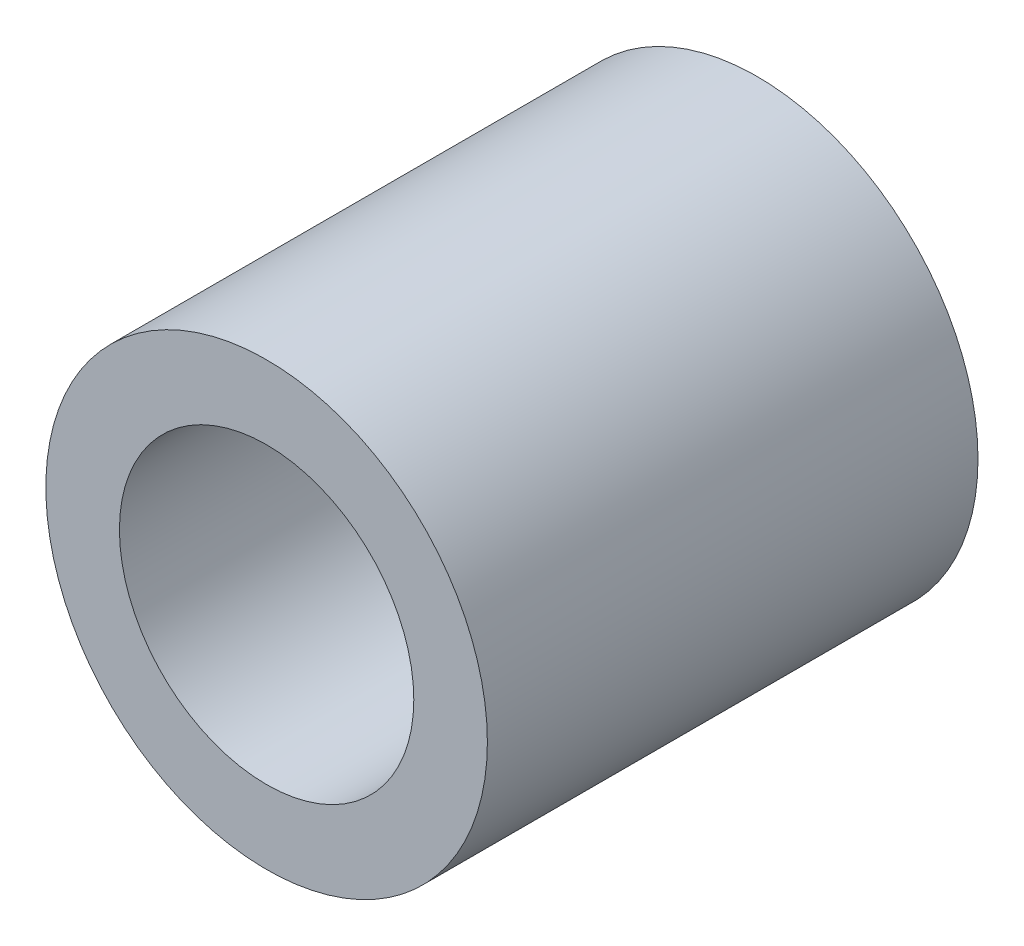
ISO-10303-21;
HEADER;
FILE_DESCRIPTION(('STEP AP214'),'2;1');
FILE_NAME('part.step','',(''),(''),'','','');
FILE_SCHEMA(('AUTOMOTIVE_DESIGN { 1 0 10303 214 1 1 1 1 }'));
ENDSEC;
DATA;
#1=APPLICATION_CONTEXT('core data for automotive mechanical design processes');
#2=APPLICATION_PROTOCOL_DEFINITION('international standard','automotive_design',2000,#1);
#3=PRODUCT_CONTEXT('',#1,'mechanical');
#4=PRODUCT('Part','Part','',(#3));
#5=PRODUCT_RELATED_PRODUCT_CATEGORY('part','',(#4));
#6=PRODUCT_DEFINITION_FORMATION('','',#4);
#7=PRODUCT_DEFINITION_CONTEXT('part definition',#1,'design');
#8=PRODUCT_DEFINITION('design','',#6,#7);
#9=PRODUCT_DEFINITION_SHAPE('','',#8);
#10=(LENGTH_UNIT() NAMED_UNIT(*) SI_UNIT(.MILLI.,.METRE.));
#11=(NAMED_UNIT(*) PLANE_ANGLE_UNIT() SI_UNIT($,.RADIAN.));
#12=(NAMED_UNIT(*) SI_UNIT($,.STERADIAN.) SOLID_ANGLE_UNIT());
#13=UNCERTAINTY_MEASURE_WITH_UNIT(LENGTH_MEASURE(1.E-05),#10,'distance_accuracy_value','');
#14=(GEOMETRIC_REPRESENTATION_CONTEXT(3) GLOBAL_UNCERTAINTY_ASSIGNED_CONTEXT((#13)) GLOBAL_UNIT_ASSIGNED_CONTEXT((#10,
#11,#12)) REPRESENTATION_CONTEXT('',''));
#15=CARTESIAN_POINT('',(0.,0.,0.));
#16=DIRECTION('',(0.,0.,1.));
#17=DIRECTION('',(1.,0.,0.));
#18=AXIS2_PLACEMENT_3D('',#15,#16,#17);
#19=CARTESIAN_POINT('',(0.,0.,10.));
#20=DIRECTION('',(0.,0.,1.));
#21=DIRECTION('',(1.,0.,0.));
#22=AXIS2_PLACEMENT_3D('',#19,#20,#21);
#23=PLANE('',#22);
#24=CARTESIAN_POINT('',(0.,0.,10.));
#25=DIRECTION('',(0.,0.,1.));
#26=DIRECTION('',(1.,0.,0.));
#27=AXIS2_PLACEMENT_3D('',#24,#25,#26);
#28=CIRCLE('',#27,4.5);
#29=CARTESIAN_POINT('',(4.5,0.,10.));
#30=VERTEX_POINT('',#29);
#31=EDGE_CURVE('E11',#30,#30,#28,.T.);
#32=ORIENTED_EDGE('',*,*,#31,.T.);
#33=EDGE_LOOP('',(#32));
#34=FACE_BOUND('',#33,.T.);
#35=CARTESIAN_POINT('',(0.,0.,10.));
#36=DIRECTION('',(0.,0.,1.));
#37=DIRECTION('',(1.,0.,0.));
#38=AXIS2_PLACEMENT_3D('',#35,#36,#37);
#39=CIRCLE('',#38,3.);
#40=CARTESIAN_POINT('',(3.,0.,10.));
#41=VERTEX_POINT('',#40);
#42=EDGE_CURVE('E56',#41,#41,#39,.T.);
#43=ORIENTED_EDGE('',*,*,#42,.F.);
#44=EDGE_LOOP('',(#43));
#45=FACE_BOUND('',#44,.T.);
#46=ADVANCED_FACE('F43',(#34,#45),#23,.T.);
#47=CARTESIAN_POINT('',(0.,0.,0.));
#48=DIRECTION('',(0.,0.,1.));
#49=DIRECTION('',(1.,0.,0.));
#50=AXIS2_PLACEMENT_3D('',#47,#48,#49);
#51=PLANE('',#50);
#52=CARTESIAN_POINT('',(0.,0.,0.));
#53=DIRECTION('',(0.,0.,1.));
#54=DIRECTION('',(1.,0.,0.));
#55=AXIS2_PLACEMENT_3D('',#52,#53,#54);
#56=CIRCLE('',#55,4.5);
#57=CARTESIAN_POINT('',(4.5,0.,0.));
#58=VERTEX_POINT('',#57);
#59=EDGE_CURVE('E47',#58,#58,#56,.T.);
#60=ORIENTED_EDGE('',*,*,#59,.F.);
#61=EDGE_LOOP('',(#60));
#62=FACE_BOUND('',#61,.T.);
#63=CARTESIAN_POINT('',(0.,0.,0.));
#64=DIRECTION('',(0.,0.,1.));
#65=DIRECTION('',(1.,0.,0.));
#66=AXIS2_PLACEMENT_3D('',#63,#64,#65);
#67=CIRCLE('',#66,3.);
#68=CARTESIAN_POINT('',(3.,0.,0.));
#69=VERTEX_POINT('',#68);
#70=EDGE_CURVE('E58',#69,#69,#67,.T.);
#71=ORIENTED_EDGE('',*,*,#70,.T.);
#72=EDGE_LOOP('',(#71));
#73=FACE_BOUND('',#72,.T.);
#74=ADVANCED_FACE('F70',(#62,#73),#51,.F.);
#75=CARTESIAN_POINT('',(0.,0.,10.));
#76=DIRECTION('',(0.,0.,-1.));
#77=DIRECTION('',(-1.,0.,0.));
#78=AXIS2_PLACEMENT_3D('',#75,#76,#77);
#79=CYLINDRICAL_SURFACE('',#78,4.5);
#80=ORIENTED_EDGE('',*,*,#31,.F.);
#81=EDGE_LOOP('',(#80));
#82=FACE_BOUND('',#81,.T.);
#83=ORIENTED_EDGE('',*,*,#59,.T.);
#84=EDGE_LOOP('',(#83));
#85=FACE_BOUND('',#84,.T.);
#86=ADVANCED_FACE('F45',(#82,#85),#79,.T.);
#87=CARTESIAN_POINT('',(0.,0.,10.));
#88=DIRECTION('',(0.,0.,-1.));
#89=DIRECTION('',(-1.,0.,0.));
#90=AXIS2_PLACEMENT_3D('',#87,#88,#89);
#91=CYLINDRICAL_SURFACE('',#90,3.);
#92=ORIENTED_EDGE('',*,*,#42,.T.);
#93=EDGE_LOOP('',(#92));
#94=FACE_BOUND('',#93,.T.);
#95=ORIENTED_EDGE('',*,*,#70,.F.);
#96=EDGE_LOOP('',(#95));
#97=FACE_BOUND('',#96,.T.);
#98=ADVANCED_FACE('F66',(#94,#97),#91,.F.);
#99=CLOSED_SHELL('',(#46,#74,#86,#98));
#100=MANIFOLD_SOLID_BREP('B2',#99);
#101=ADVANCED_BREP_SHAPE_REPRESENTATION('',(#18,#100),#14);
#102=SHAPE_DEFINITION_REPRESENTATION(#9,#101);
ENDSEC;
END-ISO-10303-21;
